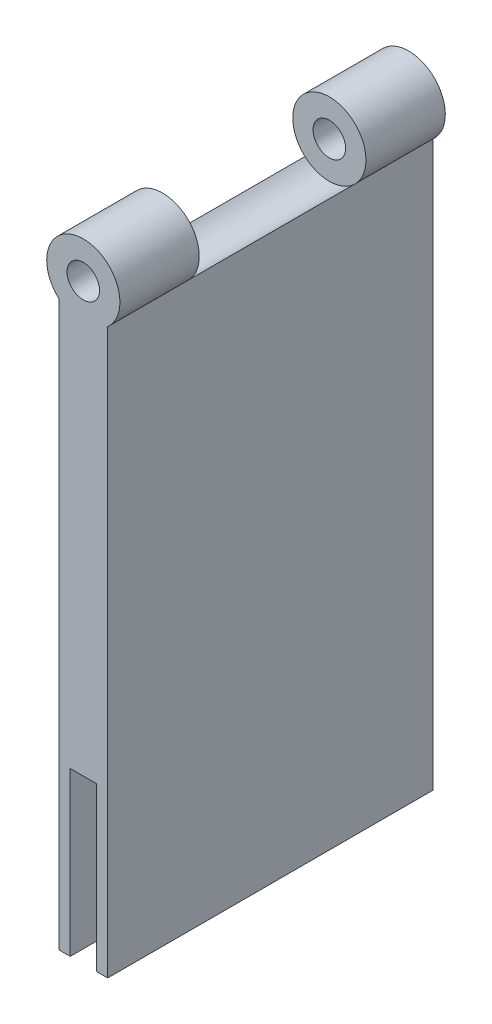
ISO-10303-21;
HEADER;
FILE_DESCRIPTION(('STEP AP214'),'2;1');
FILE_NAME('part.step','',(''),(''),'','','');
FILE_SCHEMA(('AUTOMOTIVE_DESIGN { 1 0 10303 214 1 1 1 1 }'));
ENDSEC;
DATA;
#1=APPLICATION_CONTEXT('core data for automotive mechanical design processes');
#2=APPLICATION_PROTOCOL_DEFINITION('international standard','automotive_design',2000,#1);
#3=PRODUCT_CONTEXT('',#1,'mechanical');
#4=PRODUCT('Part','Part','',(#3));
#5=PRODUCT_RELATED_PRODUCT_CATEGORY('part','',(#4));
#6=PRODUCT_DEFINITION_FORMATION('','',#4);
#7=PRODUCT_DEFINITION_CONTEXT('part definition',#1,'design');
#8=PRODUCT_DEFINITION('design','',#6,#7);
#9=PRODUCT_DEFINITION_SHAPE('','',#8);
#10=(LENGTH_UNIT() NAMED_UNIT(*) SI_UNIT(.MILLI.,.METRE.));
#11=(NAMED_UNIT(*) PLANE_ANGLE_UNIT() SI_UNIT($,.RADIAN.));
#12=(NAMED_UNIT(*) SI_UNIT($,.STERADIAN.) SOLID_ANGLE_UNIT());
#13=UNCERTAINTY_MEASURE_WITH_UNIT(LENGTH_MEASURE(1.E-05),#10,'distance_accuracy_value','');
#14=(GEOMETRIC_REPRESENTATION_CONTEXT(3) GLOBAL_UNCERTAINTY_ASSIGNED_CONTEXT((#13)) GLOBAL_UNIT_ASSIGNED_CONTEXT((#10,
#11,#12)) REPRESENTATION_CONTEXT('',''));
#15=CARTESIAN_POINT('',(0.,0.,0.));
#16=DIRECTION('',(0.,0.,1.));
#17=DIRECTION('',(1.,0.,0.));
#18=AXIS2_PLACEMENT_3D('',#15,#16,#17);
#19=CARTESIAN_POINT('',(-39.1912350597609,57.6878170857636,-29.4820717131474));
#20=DIRECTION('',(0.,0.,1.));
#21=DIRECTION('',(1.,0.,0.));
#22=AXIS2_PLACEMENT_3D('',#19,#20,#21);
#23=CYLINDRICAL_SURFACE('',#22,4.5);
#24=CARTESIAN_POINT('',(-39.1912350597609,57.6878170857636,0.763528483852232));
#25=DIRECTION('',(0.,0.,-1.));
#26=DIRECTION('',(-1.,0.,0.));
#27=AXIS2_PLACEMENT_3D('',#24,#25,#26);
#28=CIRCLE('',#27,4.5);
#29=CARTESIAN_POINT('',(-36.1912350597609,54.3337151195139,0.763528483852231));
#30=VERTEX_POINT('',#29);
#31=CARTESIAN_POINT('',(-42.1912350597609,54.3337151195139,0.763528483852233));
#32=VERTEX_POINT('',#31);
#33=EDGE_CURVE('E168',#30,#32,#28,.F.);
#34=ORIENTED_EDGE('',*,*,#33,.T.);
#35=DIRECTION('',(0.,0.,1.));
#36=VECTOR('',#35,1.);
#37=CARTESIAN_POINT('',(-42.1912350597609,54.3337151195139,-29.4820717131474));
#38=LINE('',#37,#36);
#39=CARTESIAN_POINT('',(-42.1912350597609,54.3337151195139,10.5179282868526));
#40=VERTEX_POINT('',#39);
#41=EDGE_CURVE('E185',#40,#32,#38,.F.);
#42=ORIENTED_EDGE('',*,*,#41,.F.);
#43=CARTESIAN_POINT('',(-39.1912350597609,57.6878170857636,10.5179282868526));
#44=DIRECTION('',(0.,0.,1.));
#45=DIRECTION('',(1.,0.,0.));
#46=AXIS2_PLACEMENT_3D('',#43,#44,#45);
#47=CIRCLE('',#46,4.5);
#48=CARTESIAN_POINT('',(-36.1912350597609,54.3337151195139,10.5179282868526));
#49=VERTEX_POINT('',#48);
#50=EDGE_CURVE('E176',#49,#40,#47,.T.);
#51=ORIENTED_EDGE('',*,*,#50,.F.);
#52=DIRECTION('',(0.,0.,1.));
#53=VECTOR('',#52,1.);
#54=CARTESIAN_POINT('',(-36.191235059761,54.3337151195139,-29.4820717131474));
#55=LINE('',#54,#53);
#56=EDGE_CURVE('E188',#30,#49,#55,.T.);
#57=ORIENTED_EDGE('',*,*,#56,.F.);
#58=EDGE_LOOP('',(#34,#42,#51,#57));
#59=FACE_BOUND('',#58,.T.);
#60=ADVANCED_FACE('F37',(#59),#23,.T.);
#61=CARTESIAN_POINT('',(-42.1912350597609,54.3337151195139,-19.727671910147));
#62=VERTEX_POINT('',#61);
#63=CARTESIAN_POINT('',(-42.1912350597609,54.3337151195139,-29.4820717131474));
#64=VERTEX_POINT('',#63);
#65=EDGE_CURVE('E182',#62,#64,#38,.F.);
#66=ORIENTED_EDGE('',*,*,#65,.F.);
#67=CARTESIAN_POINT('',(-39.1912350597609,57.6878170857636,-19.727671910147));
#68=DIRECTION('',(0.,0.,-1.));
#69=DIRECTION('',(-1.,0.,0.));
#70=AXIS2_PLACEMENT_3D('',#67,#68,#69);
#71=CIRCLE('',#70,4.5);
#72=CARTESIAN_POINT('',(-36.191235059761,54.3337151195139,-19.727671910147));
#73=VERTEX_POINT('',#72);
#74=EDGE_CURVE('E170',#73,#62,#71,.F.);
#75=ORIENTED_EDGE('',*,*,#74,.F.);
#76=CARTESIAN_POINT('',(-36.191235059761,54.3337151195139,-29.4820717131474));
#77=VERTEX_POINT('',#76);
#78=EDGE_CURVE('E189',#77,#73,#55,.T.);
#79=ORIENTED_EDGE('',*,*,#78,.F.);
#80=CARTESIAN_POINT('',(-39.1912350597609,57.6878170857636,-29.4820717131474));
#81=DIRECTION('',(0.,0.,1.));
#82=DIRECTION('',(1.,0.,0.));
#83=AXIS2_PLACEMENT_3D('',#80,#81,#82);
#84=CIRCLE('',#83,4.5);
#85=EDGE_CURVE('E179',#77,#64,#84,.T.);
#86=ORIENTED_EDGE('',*,*,#85,.T.);
#87=EDGE_LOOP('',(#66,#75,#79,#86));
#88=FACE_BOUND('',#87,.T.);
#89=ADVANCED_FACE('F206',(#88),#23,.T.);
#90=CARTESIAN_POINT('',(-39.1912350597609,57.6878170857636,-29.4820717131474));
#91=DIRECTION('',(0.,0.,1.));
#92=DIRECTION('',(1.,0.,0.));
#93=AXIS2_PLACEMENT_3D('',#90,#91,#92);
#94=CYLINDRICAL_SURFACE('',#93,2.);
#95=CARTESIAN_POINT('',(-39.1912350597609,57.6878170857636,10.5179282868526));
#96=DIRECTION('',(0.,0.,1.));
#97=DIRECTION('',(1.,0.,0.));
#98=AXIS2_PLACEMENT_3D('',#95,#96,#97);
#99=CIRCLE('',#98,2.);
#100=CARTESIAN_POINT('',(-37.1912350597609,57.6878170857636,10.5179282868526));
#101=VERTEX_POINT('',#100);
#102=EDGE_CURVE('E172',#101,#101,#99,.T.);
#103=ORIENTED_EDGE('',*,*,#102,.T.);
#104=EDGE_LOOP('',(#103));
#105=FACE_BOUND('',#104,.T.);
#106=CARTESIAN_POINT('',(-39.1912350597609,57.6878170857636,0.763528483852232));
#107=DIRECTION('',(0.,0.,-1.));
#108=DIRECTION('',(-1.,0.,0.));
#109=AXIS2_PLACEMENT_3D('',#106,#107,#108);
#110=CIRCLE('',#109,2.);
#111=CARTESIAN_POINT('',(-41.191235059761,57.6878170857636,0.763528483852233));
#112=VERTEX_POINT('',#111);
#113=EDGE_CURVE('E167',#112,#112,#110,.F.);
#114=ORIENTED_EDGE('',*,*,#113,.F.);
#115=EDGE_LOOP('',(#114));
#116=FACE_BOUND('',#115,.T.);
#117=ADVANCED_FACE('F204',(#105,#116),#94,.F.);
#118=CARTESIAN_POINT('',(-36.191235059761,60.,-29.4820717131474));
#119=DIRECTION('',(-1.,0.,0.));
#120=DIRECTION('',(0.,0.,1.));
#121=AXIS2_PLACEMENT_3D('',#118,#119,#120);
#122=PLANE('',#121);
#123=DIRECTION('',(0.,-1.,0.));
#124=VECTOR('',#123,1.);
#125=CARTESIAN_POINT('',(-36.191235059761,60.,-29.4820717131474));
#126=LINE('',#125,#124);
#127=CARTESIAN_POINT('',(-36.191235059761,-15.,-29.4820717131474));
#128=VERTEX_POINT('',#127);
#129=EDGE_CURVE('E11',#77,#128,#126,.T.);
#130=ORIENTED_EDGE('',*,*,#129,.F.);
#131=ORIENTED_EDGE('',*,*,#78,.T.);
#132=DIRECTION('',(0.,0.,1.));
#133=VECTOR('',#132,1.);
#134=CARTESIAN_POINT('',(-36.191235059761,54.3337151195139,-32.4555939715049));
#135=LINE('',#134,#133);
#136=EDGE_CURVE('E164',#30,#73,#135,.F.);
#137=ORIENTED_EDGE('',*,*,#136,.F.);
#138=ORIENTED_EDGE('',*,*,#56,.T.);
#139=DIRECTION('',(0.,-1.,0.));
#140=VECTOR('',#139,1.);
#141=CARTESIAN_POINT('',(-36.1912350597609,60.,10.5179282868526));
#142=LINE('',#141,#140);
#143=CARTESIAN_POINT('',(-36.191235059761,-15.,10.5179282868526));
#144=VERTEX_POINT('',#143);
#145=EDGE_CURVE('E118',#49,#144,#142,.T.);
#146=ORIENTED_EDGE('',*,*,#145,.T.);
#147=DIRECTION('',(0.,0.,1.));
#148=VECTOR('',#147,1.);
#149=CARTESIAN_POINT('',(-36.191235059761,-15.,10.5179282868526));
#150=LINE('',#149,#148);
#151=EDGE_CURVE('E129',#128,#144,#150,.T.);
#152=ORIENTED_EDGE('',*,*,#151,.F.);
#153=EDGE_LOOP('',(#130,#131,#137,#138,#146,#152));
#154=FACE_BOUND('',#153,.T.);
#155=ADVANCED_FACE('F39',(#154),#122,.F.);
#156=CARTESIAN_POINT('',(-42.1912350597609,60.,-29.4820717131474));
#157=DIRECTION('',(0.,0.,1.));
#158=DIRECTION('',(1.,0.,0.));
#159=AXIS2_PLACEMENT_3D('',#156,#157,#158);
#160=PLANE('',#159);
#161=DIRECTION('',(0.,-1.,0.));
#162=VECTOR('',#161,1.);
#163=CARTESIAN_POINT('',(-37.5956266533898,20.,-29.4820717131474));
#164=LINE('',#163,#162);
#165=CARTESIAN_POINT('',(-37.5956266533898,5.,-29.4820717131474));
#166=VERTEX_POINT('',#165);
#167=CARTESIAN_POINT('',(-37.5956266533898,-15.,-29.4820717131474));
#168=VERTEX_POINT('',#167);
#169=EDGE_CURVE('E110',#166,#168,#164,.T.);
#170=ORIENTED_EDGE('',*,*,#169,.F.);
#171=DIRECTION('',(1.,0.,0.));
#172=VECTOR('',#171,1.);
#173=CARTESIAN_POINT('',(-40.7956266533898,5.,-29.4820717131474));
#174=LINE('',#173,#172);
#175=CARTESIAN_POINT('',(-40.7956266533898,5.,-29.4820717131474));
#176=VERTEX_POINT('',#175);
#177=EDGE_CURVE('E395',#176,#166,#174,.T.);
#178=ORIENTED_EDGE('',*,*,#177,.F.);
#179=DIRECTION('',(0.,-1.,0.));
#180=VECTOR('',#179,1.);
#181=CARTESIAN_POINT('',(-40.7956266533898,20.,-29.4820717131474));
#182=LINE('',#181,#180);
#183=CARTESIAN_POINT('',(-40.7956266533898,-15.,-29.4820717131474));
#184=VERTEX_POINT('',#183);
#185=EDGE_CURVE('E119',#176,#184,#182,.T.);
#186=ORIENTED_EDGE('',*,*,#185,.T.);
#187=DIRECTION('',(1.,0.,0.));
#188=VECTOR('',#187,1.);
#189=CARTESIAN_POINT('',(-42.1912350597609,-15.,-29.4820717131474));
#190=LINE('',#189,#188);
#191=CARTESIAN_POINT('',(-42.1912350597609,-15.,-29.4820717131474));
#192=VERTEX_POINT('',#191);
#193=EDGE_CURVE('E146',#192,#184,#190,.T.);
#194=ORIENTED_EDGE('',*,*,#193,.F.);
#195=DIRECTION('',(0.,-1.,0.));
#196=VECTOR('',#195,1.);
#197=CARTESIAN_POINT('',(-42.1912350597609,60.,-29.4820717131474));
#198=LINE('',#197,#196);
#199=EDGE_CURVE('E46',#64,#192,#198,.T.);
#200=ORIENTED_EDGE('',*,*,#199,.F.);
#201=ORIENTED_EDGE('',*,*,#85,.F.);
#202=ORIENTED_EDGE('',*,*,#129,.T.);
#203=DIRECTION('',(1.,0.,0.));
#204=VECTOR('',#203,1.);
#205=CARTESIAN_POINT('',(-37.5956266533898,-15.,-29.4820717131474));
#206=LINE('',#205,#204);
#207=EDGE_CURVE('E122',#168,#128,#206,.T.);
#208=ORIENTED_EDGE('',*,*,#207,.F.);
#209=EDGE_LOOP('',(#170,#178,#186,#194,#200,#201,#202,#208));
#210=FACE_BOUND('',#209,.T.);
#211=CARTESIAN_POINT('',(-39.1912350597609,57.6878170857636,-29.4820717131474));
#212=DIRECTION('',(0.,0.,1.));
#213=DIRECTION('',(1.,0.,0.));
#214=AXIS2_PLACEMENT_3D('',#211,#212,#213);
#215=CIRCLE('',#214,2.);
#216=CARTESIAN_POINT('',(-37.1912350597609,57.6878170857636,-29.4820717131474));
#217=VERTEX_POINT('',#216);
#218=EDGE_CURVE('E173',#217,#217,#215,.T.);
#219=ORIENTED_EDGE('',*,*,#218,.T.);
#220=EDGE_LOOP('',(#219));
#221=FACE_BOUND('',#220,.T.);
#222=ADVANCED_FACE('F123',(#210,#221),#160,.F.);
#223=CARTESIAN_POINT('',(-42.1912350597609,60.,-29.4820717131474));
#224=DIRECTION('',(1.,0.,0.));
#225=DIRECTION('',(0.,0.,-1.));
#226=AXIS2_PLACEMENT_3D('',#223,#224,#225);
#227=PLANE('',#226);
#228=DIRECTION('',(0.,-1.,0.));
#229=VECTOR('',#228,1.);
#230=CARTESIAN_POINT('',(-42.1912350597609,60.,10.5179282868526));
#231=LINE('',#230,#229);
#232=CARTESIAN_POINT('',(-42.1912350597609,-15.,10.5179282868526));
#233=VERTEX_POINT('',#232);
#234=EDGE_CURVE('E197',#40,#233,#231,.T.);
#235=ORIENTED_EDGE('',*,*,#234,.F.);
#236=ORIENTED_EDGE('',*,*,#41,.T.);
#237=DIRECTION('',(0.,0.,1.));
#238=VECTOR('',#237,1.);
#239=CARTESIAN_POINT('',(-42.1912350597609,54.3337151195139,-32.4555939715049));
#240=LINE('',#239,#238);
#241=EDGE_CURVE('E161',#62,#32,#240,.T.);
#242=ORIENTED_EDGE('',*,*,#241,.F.);
#243=ORIENTED_EDGE('',*,*,#65,.T.);
#244=ORIENTED_EDGE('',*,*,#199,.T.);
#245=DIRECTION('',(0.,0.,-1.));
#246=VECTOR('',#245,1.);
#247=CARTESIAN_POINT('',(-42.1912350597609,-15.,10.5179282868526));
#248=LINE('',#247,#246);
#249=EDGE_CURVE('E143',#233,#192,#248,.T.);
#250=ORIENTED_EDGE('',*,*,#249,.F.);
#251=EDGE_LOOP('',(#235,#236,#242,#243,#244,#250));
#252=FACE_BOUND('',#251,.T.);
#253=ADVANCED_FACE('F235',(#252),#227,.F.);
#254=CARTESIAN_POINT('',(-42.1912350597609,60.,10.5179282868526));
#255=DIRECTION('',(0.,0.,-1.));
#256=DIRECTION('',(-1.,0.,0.));
#257=AXIS2_PLACEMENT_3D('',#254,#255,#256);
#258=PLANE('',#257);
#259=DIRECTION('',(-1.,0.,0.));
#260=VECTOR('',#259,1.);
#261=CARTESIAN_POINT('',(-40.7956266533898,5.,10.5179282868526));
#262=LINE('',#261,#260);
#263=CARTESIAN_POINT('',(-37.5956266533898,5.,10.5179282868526));
#264=VERTEX_POINT('',#263);
#265=CARTESIAN_POINT('',(-40.7956266533898,5.,10.5179282868526));
#266=VERTEX_POINT('',#265);
#267=EDGE_CURVE('E135',#264,#266,#262,.T.);
#268=ORIENTED_EDGE('',*,*,#267,.F.);
#269=DIRECTION('',(0.,-1.,0.));
#270=VECTOR('',#269,1.);
#271=CARTESIAN_POINT('',(-37.5956266533898,20.,10.5179282868526));
#272=LINE('',#271,#270);
#273=CARTESIAN_POINT('',(-37.5956266533898,-15.,10.5179282868526));
#274=VERTEX_POINT('',#273);
#275=EDGE_CURVE('E54',#264,#274,#272,.T.);
#276=ORIENTED_EDGE('',*,*,#275,.T.);
#277=DIRECTION('',(-1.,0.,0.));
#278=VECTOR('',#277,1.);
#279=CARTESIAN_POINT('',(-37.5956266533898,-15.,10.5179282868526));
#280=LINE('',#279,#278);
#281=EDGE_CURVE('E134',#144,#274,#280,.T.);
#282=ORIENTED_EDGE('',*,*,#281,.F.);
#283=ORIENTED_EDGE('',*,*,#145,.F.);
#284=ORIENTED_EDGE('',*,*,#50,.T.);
#285=ORIENTED_EDGE('',*,*,#234,.T.);
#286=DIRECTION('',(-1.,0.,0.));
#287=VECTOR('',#286,1.);
#288=CARTESIAN_POINT('',(-42.1912350597609,-15.,10.5179282868526));
#289=LINE('',#288,#287);
#290=CARTESIAN_POINT('',(-40.7956266533898,-15.,10.5179282868526));
#291=VERTEX_POINT('',#290);
#292=EDGE_CURVE('E152',#291,#233,#289,.T.);
#293=ORIENTED_EDGE('',*,*,#292,.F.);
#294=DIRECTION('',(0.,-1.,0.));
#295=VECTOR('',#294,1.);
#296=CARTESIAN_POINT('',(-40.7956266533898,20.,10.5179282868526));
#297=LINE('',#296,#295);
#298=EDGE_CURVE('E193',#266,#291,#297,.T.);
#299=ORIENTED_EDGE('',*,*,#298,.F.);
#300=EDGE_LOOP('',(#268,#276,#282,#283,#284,#285,#293,#299));
#301=FACE_BOUND('',#300,.T.);
#302=ORIENTED_EDGE('',*,*,#102,.F.);
#303=EDGE_LOOP('',(#302));
#304=FACE_BOUND('',#303,.T.);
#305=ADVANCED_FACE('F232',(#301,#304),#258,.F.);
#306=CARTESIAN_POINT('',(-37.5956266533898,20.,-29.4820717131474));
#307=DIRECTION('',(1.,0.,0.));
#308=DIRECTION('',(0.,0.,-1.));
#309=AXIS2_PLACEMENT_3D('',#306,#307,#308);
#310=PLANE('',#309);
#311=ORIENTED_EDGE('',*,*,#275,.F.);
#312=DIRECTION('',(0.,0.,1.));
#313=VECTOR('',#312,1.);
#314=CARTESIAN_POINT('',(-37.5956266533898,5.,10.5179282868526));
#315=LINE('',#314,#313);
#316=EDGE_CURVE('E58',#166,#264,#315,.T.);
#317=ORIENTED_EDGE('',*,*,#316,.F.);
#318=ORIENTED_EDGE('',*,*,#169,.T.);
#319=DIRECTION('',(0.,0.,-1.));
#320=VECTOR('',#319,1.);
#321=CARTESIAN_POINT('',(-37.5956266533898,-15.,10.5179282868526));
#322=LINE('',#321,#320);
#323=EDGE_CURVE('E114',#274,#168,#322,.T.);
#324=ORIENTED_EDGE('',*,*,#323,.F.);
#325=EDGE_LOOP('',(#311,#317,#318,#324));
#326=FACE_BOUND('',#325,.T.);
#327=ADVANCED_FACE('F112',(#326),#310,.F.);
#328=CARTESIAN_POINT('',(-40.7956266533898,20.,-29.4820717131474));
#329=DIRECTION('',(-1.,0.,0.));
#330=DIRECTION('',(0.,0.,1.));
#331=AXIS2_PLACEMENT_3D('',#328,#329,#330);
#332=PLANE('',#331);
#333=ORIENTED_EDGE('',*,*,#185,.F.);
#334=DIRECTION('',(0.,0.,-1.));
#335=VECTOR('',#334,1.);
#336=CARTESIAN_POINT('',(-40.7956266533898,5.,10.5179282868526));
#337=LINE('',#336,#335);
#338=EDGE_CURVE('E394',#266,#176,#337,.T.);
#339=ORIENTED_EDGE('',*,*,#338,.F.);
#340=ORIENTED_EDGE('',*,*,#298,.T.);
#341=DIRECTION('',(0.,0.,1.));
#342=VECTOR('',#341,1.);
#343=CARTESIAN_POINT('',(-40.7956266533898,-15.,10.5179282868526));
#344=LINE('',#343,#342);
#345=EDGE_CURVE('E149',#184,#291,#344,.T.);
#346=ORIENTED_EDGE('',*,*,#345,.F.);
#347=EDGE_LOOP('',(#333,#339,#340,#346));
#348=FACE_BOUND('',#347,.T.);
#349=ADVANCED_FACE('F220',(#348),#332,.F.);
#350=CARTESIAN_POINT('',(-39.1912350597609,57.6878170857636,-19.727671910147));
#351=DIRECTION('',(0.,0.,-1.));
#352=DIRECTION('',(-1.,0.,0.));
#353=AXIS2_PLACEMENT_3D('',#350,#351,#352);
#354=CIRCLE('',#353,2.);
#355=CARTESIAN_POINT('',(-41.191235059761,57.6878170857636,-19.727671910147));
#356=VERTEX_POINT('',#355);
#357=EDGE_CURVE('E41',#356,#356,#354,.F.);
#358=ORIENTED_EDGE('',*,*,#357,.T.);
#359=EDGE_LOOP('',(#358));
#360=FACE_BOUND('',#359,.T.);
#361=ORIENTED_EDGE('',*,*,#218,.F.);
#362=EDGE_LOOP('',(#361));
#363=FACE_BOUND('',#362,.T.);
#364=ADVANCED_FACE('F209',(#360,#363),#94,.F.);
#365=CARTESIAN_POINT('',(-43.691235059761,55.0378170857636,-19.727671910147));
#366=DIRECTION('',(0.,0.,-1.));
#367=DIRECTION('',(-1.,0.,0.));
#368=AXIS2_PLACEMENT_3D('',#365,#366,#367);
#369=PLANE('',#368);
#370=ORIENTED_EDGE('',*,*,#74,.T.);
#371=CARTESIAN_POINT('',(-39.1912350597609,57.6878170857636,-19.727671910147));
#372=DIRECTION('',(0.,0.,-1.));
#373=DIRECTION('',(-1.,0.,0.));
#374=AXIS2_PLACEMENT_3D('',#371,#372,#373);
#375=CIRCLE('',#374,4.5);
#376=EDGE_CURVE('E158',#73,#62,#375,.T.);
#377=ORIENTED_EDGE('',*,*,#376,.F.);
#378=EDGE_LOOP('',(#370,#377));
#379=FACE_BOUND('',#378,.T.);
#380=ORIENTED_EDGE('',*,*,#357,.F.);
#381=EDGE_LOOP('',(#380));
#382=FACE_BOUND('',#381,.T.);
#383=ADVANCED_FACE('F219',(#379,#382),#369,.F.);
#384=CARTESIAN_POINT('',(-43.691235059761,55.0378170857636,0.763528483852233));
#385=DIRECTION('',(0.,0.,-1.));
#386=DIRECTION('',(-1.,0.,0.));
#387=AXIS2_PLACEMENT_3D('',#384,#385,#386);
#388=PLANE('',#387);
#389=ORIENTED_EDGE('',*,*,#33,.F.);
#390=CARTESIAN_POINT('',(-39.1912350597609,57.6878170857636,0.763528483852232));
#391=DIRECTION('',(0.,0.,-1.));
#392=DIRECTION('',(-1.,0.,0.));
#393=AXIS2_PLACEMENT_3D('',#390,#391,#392);
#394=CIRCLE('',#393,4.5);
#395=EDGE_CURVE('E155',#30,#32,#394,.T.);
#396=ORIENTED_EDGE('',*,*,#395,.T.);
#397=EDGE_LOOP('',(#389,#396));
#398=FACE_BOUND('',#397,.T.);
#399=ORIENTED_EDGE('',*,*,#113,.T.);
#400=EDGE_LOOP('',(#399));
#401=FACE_BOUND('',#400,.T.);
#402=ADVANCED_FACE('F202',(#398,#401),#388,.T.);
#403=CARTESIAN_POINT('',(-39.191235059761,57.6878170857636,-32.4555939715049));
#404=DIRECTION('',(0.,0.,1.));
#405=DIRECTION('',(1.,0.,0.));
#406=AXIS2_PLACEMENT_3D('',#403,#404,#405);
#407=CYLINDRICAL_SURFACE('',#406,4.5);
#408=ORIENTED_EDGE('',*,*,#136,.T.);
#409=ORIENTED_EDGE('',*,*,#376,.T.);
#410=ORIENTED_EDGE('',*,*,#241,.T.);
#411=ORIENTED_EDGE('',*,*,#395,.F.);
#412=EDGE_LOOP('',(#408,#409,#410,#411));
#413=FACE_BOUND('',#412,.T.);
#414=ADVANCED_FACE('F280',(#413),#407,.F.);
#415=CARTESIAN_POINT('',(0.,-15.,0.));
#416=DIRECTION('',(0.,-1.,0.));
#417=DIRECTION('',(0.,0.,-1.));
#418=AXIS2_PLACEMENT_3D('',#415,#416,#417);
#419=PLANE('',#418);
#420=ORIENTED_EDGE('',*,*,#249,.T.);
#421=ORIENTED_EDGE('',*,*,#193,.T.);
#422=ORIENTED_EDGE('',*,*,#345,.T.);
#423=ORIENTED_EDGE('',*,*,#292,.T.);
#424=EDGE_LOOP('',(#420,#421,#422,#423));
#425=FACE_BOUND('',#424,.T.);
#426=ADVANCED_FACE('F288',(#425),#419,.T.);
#427=CARTESIAN_POINT('',(0.,-15.,0.));
#428=DIRECTION('',(0.,-1.,0.));
#429=DIRECTION('',(0.,0.,-1.));
#430=AXIS2_PLACEMENT_3D('',#427,#428,#429);
#431=PLANE('',#430);
#432=ORIENTED_EDGE('',*,*,#323,.T.);
#433=ORIENTED_EDGE('',*,*,#207,.T.);
#434=ORIENTED_EDGE('',*,*,#151,.T.);
#435=ORIENTED_EDGE('',*,*,#281,.T.);
#436=EDGE_LOOP('',(#432,#433,#434,#435));
#437=FACE_BOUND('',#436,.T.);
#438=ADVANCED_FACE('F132',(#437),#431,.T.);
#439=CARTESIAN_POINT('',(0.,5.,0.));
#440=DIRECTION('',(0.,-1.,0.));
#441=DIRECTION('',(0.,0.,-1.));
#442=AXIS2_PLACEMENT_3D('',#439,#440,#441);
#443=PLANE('',#442);
#444=ORIENTED_EDGE('',*,*,#338,.T.);
#445=ORIENTED_EDGE('',*,*,#177,.T.);
#446=ORIENTED_EDGE('',*,*,#316,.T.);
#447=ORIENTED_EDGE('',*,*,#267,.T.);
#448=EDGE_LOOP('',(#444,#445,#446,#447));
#449=FACE_BOUND('',#448,.T.);
#450=ADVANCED_FACE('F301',(#449),#443,.T.);
#451=CLOSED_SHELL('',(#60,#89,#117,#155,#222,#253,#305,#327,#349,#364,#383,#402,#414,#426,#438,#450));
#452=MANIFOLD_SOLID_BREP('B2',#451);
#453=ADVANCED_BREP_SHAPE_REPRESENTATION('',(#18,#452),#14);
#454=SHAPE_DEFINITION_REPRESENTATION(#9,#453);
ENDSEC;
END-ISO-10303-21;
